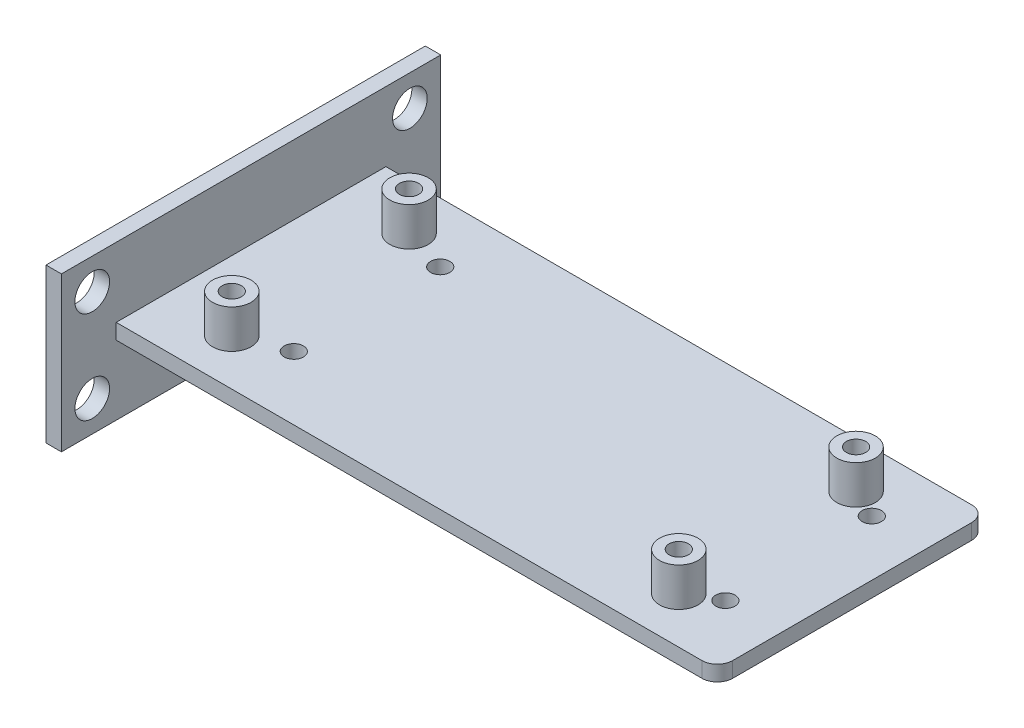
ISO-10303-21;
HEADER;
FILE_DESCRIPTION(('STEP AP214'),'2;1');
FILE_NAME('part.step','',(''),(''),'','','');
FILE_SCHEMA(('AUTOMOTIVE_DESIGN { 1 0 10303 214 1 1 1 1 }'));
ENDSEC;
DATA;
#1=APPLICATION_CONTEXT('core data for automotive mechanical design processes');
#2=APPLICATION_PROTOCOL_DEFINITION('international standard','automotive_design',2000,#1);
#3=PRODUCT_CONTEXT('',#1,'mechanical');
#4=PRODUCT('Part','Part','',(#3));
#5=PRODUCT_RELATED_PRODUCT_CATEGORY('part','',(#4));
#6=PRODUCT_DEFINITION_FORMATION('','',#4);
#7=PRODUCT_DEFINITION_CONTEXT('part definition',#1,'design');
#8=PRODUCT_DEFINITION('design','',#6,#7);
#9=PRODUCT_DEFINITION_SHAPE('','',#8);
#10=(LENGTH_UNIT() NAMED_UNIT(*) SI_UNIT(.MILLI.,.METRE.));
#11=(NAMED_UNIT(*) PLANE_ANGLE_UNIT() SI_UNIT($,.RADIAN.));
#12=(NAMED_UNIT(*) SI_UNIT($,.STERADIAN.) SOLID_ANGLE_UNIT());
#13=UNCERTAINTY_MEASURE_WITH_UNIT(LENGTH_MEASURE(1.E-05),#10,'distance_accuracy_value','');
#14=(GEOMETRIC_REPRESENTATION_CONTEXT(3) GLOBAL_UNCERTAINTY_ASSIGNED_CONTEXT((#13)) GLOBAL_UNIT_ASSIGNED_CONTEXT((#10,
#11,#12)) REPRESENTATION_CONTEXT('',''));
#15=CARTESIAN_POINT('',(0.,0.,0.));
#16=DIRECTION('',(0.,0.,1.));
#17=DIRECTION('',(1.,0.,0.));
#18=AXIS2_PLACEMENT_3D('',#15,#16,#17);
#19=CARTESIAN_POINT('',(0.,0.,0.));
#20=DIRECTION('',(0.,1.,0.));
#21=DIRECTION('',(0.,0.,1.));
#22=AXIS2_PLACEMENT_3D('',#19,#20,#21);
#23=PLANE('',#22);
#24=CARTESIAN_POINT('',(16.7893297206262,0.,7.74598307480065));
#25=DIRECTION('',(0.,1.,0.));
#26=DIRECTION('',(0.,0.,1.));
#27=AXIS2_PLACEMENT_3D('',#24,#25,#26);
#28=CIRCLE('',#27,2.5);
#29=CARTESIAN_POINT('',(16.7893297206262,0.,10.2459830748006));
#30=VERTEX_POINT('',#29);
#31=EDGE_CURVE('E42',#30,#30,#28,.F.);
#32=ORIENTED_EDGE('',*,*,#31,.F.);
#33=EDGE_LOOP('',(#32));
#34=FACE_BOUND('',#33,.T.);
#35=CARTESIAN_POINT('',(72.789329720626,0.,26.7459830748007));
#36=DIRECTION('',(0.,1.,0.));
#37=DIRECTION('',(0.,0.,1.));
#38=AXIS2_PLACEMENT_3D('',#35,#36,#37);
#39=CIRCLE('',#38,2.50000000000001);
#40=CARTESIAN_POINT('',(72.789329720626,0.,29.2459830748007));
#41=VERTEX_POINT('',#40);
#42=EDGE_CURVE('E289',#41,#41,#39,.F.);
#43=ORIENTED_EDGE('',*,*,#42,.F.);
#44=EDGE_LOOP('',(#43));
#45=FACE_BOUND('',#44,.T.);
#46=CARTESIAN_POINT('',(11.,0.,6.00000000000001));
#47=DIRECTION('',(0.,1.,0.));
#48=DIRECTION('',(0.,0.,1.));
#49=AXIS2_PLACEMENT_3D('',#46,#47,#48);
#50=CIRCLE('',#49,1.25);
#51=CARTESIAN_POINT('',(11.,0.,7.25000000000001));
#52=VERTEX_POINT('',#51);
#53=EDGE_CURVE('E204',#52,#52,#50,.T.);
#54=ORIENTED_EDGE('',*,*,#53,.T.);
#55=EDGE_LOOP('',(#54));
#56=FACE_BOUND('',#55,.T.);
#57=CARTESIAN_POINT('',(69.,0.,29.));
#58=DIRECTION('',(0.,1.,0.));
#59=DIRECTION('',(0.,0.,1.));
#60=AXIS2_PLACEMENT_3D('',#57,#58,#59);
#61=CIRCLE('',#60,1.25);
#62=CARTESIAN_POINT('',(69.,0.,30.25));
#63=VERTEX_POINT('',#62);
#64=EDGE_CURVE('E197',#63,#63,#61,.T.);
#65=ORIENTED_EDGE('',*,*,#64,.T.);
#66=EDGE_LOOP('',(#65));
#67=FACE_BOUND('',#66,.T.);
#68=CARTESIAN_POINT('',(69.,0.,5.99999999999999));
#69=DIRECTION('',(0.,1.,0.));
#70=DIRECTION('',(0.,0.,1.));
#71=AXIS2_PLACEMENT_3D('',#68,#69,#70);
#72=CIRCLE('',#71,1.25);
#73=CARTESIAN_POINT('',(69.,0.,7.24999999999999));
#74=VERTEX_POINT('',#73);
#75=EDGE_CURVE('E200',#74,#74,#72,.T.);
#76=ORIENTED_EDGE('',*,*,#75,.T.);
#77=EDGE_LOOP('',(#76));
#78=FACE_BOUND('',#77,.T.);
#79=CARTESIAN_POINT('',(11.,0.,29.));
#80=DIRECTION('',(0.,1.,0.));
#81=DIRECTION('',(0.,0.,1.));
#82=AXIS2_PLACEMENT_3D('',#79,#80,#81);
#83=CIRCLE('',#82,1.25);
#84=CARTESIAN_POINT('',(11.,0.,30.25));
#85=VERTEX_POINT('',#84);
#86=EDGE_CURVE('E201',#85,#85,#83,.T.);
#87=ORIENTED_EDGE('',*,*,#86,.T.);
#88=EDGE_LOOP('',(#87));
#89=FACE_BOUND('',#88,.T.);
#90=CARTESIAN_POINT('',(16.789329720626,0.,26.7459830748006));
#91=DIRECTION('',(0.,1.,0.));
#92=DIRECTION('',(0.,0.,1.));
#93=AXIS2_PLACEMENT_3D('',#90,#91,#92);
#94=CIRCLE('',#93,2.5);
#95=CARTESIAN_POINT('',(16.789329720626,0.,29.2459830748006));
#96=VERTEX_POINT('',#95);
#97=EDGE_CURVE('E286',#96,#96,#94,.F.);
#98=ORIENTED_EDGE('',*,*,#97,.F.);
#99=EDGE_LOOP('',(#98));
#100=FACE_BOUND('',#99,.T.);
#101=CARTESIAN_POINT('',(72.7893297206262,0.,7.74598307480064));
#102=DIRECTION('',(0.,1.,0.));
#103=DIRECTION('',(0.,0.,1.));
#104=AXIS2_PLACEMENT_3D('',#101,#102,#103);
#105=CIRCLE('',#104,2.49999999999999);
#106=CARTESIAN_POINT('',(72.7893297206262,0.,10.2459830748006));
#107=VERTEX_POINT('',#106);
#108=EDGE_CURVE('E292',#107,#107,#105,.F.);
#109=ORIENTED_EDGE('',*,*,#108,.F.);
#110=EDGE_LOOP('',(#109));
#111=FACE_BOUND('',#110,.T.);
#112=DIRECTION('',(0.,0.,1.));
#113=VECTOR('',#112,1.);
#114=CARTESIAN_POINT('',(2.,0.,0.));
#115=LINE('',#114,#113);
#116=CARTESIAN_POINT('',(2.,0.,0.));
#117=VERTEX_POINT('',#116);
#118=CARTESIAN_POINT('',(2.00000000000001,0.,35.));
#119=VERTEX_POINT('',#118);
#120=EDGE_CURVE('E156',#117,#119,#115,.T.);
#121=ORIENTED_EDGE('',*,*,#120,.F.);
#122=DIRECTION('',(-1.,0.,0.));
#123=VECTOR('',#122,1.);
#124=CARTESIAN_POINT('',(0.,0.,0.));
#125=LINE('',#124,#123);
#126=CARTESIAN_POINT('',(78.,0.,0.));
#127=VERTEX_POINT('',#126);
#128=EDGE_CURVE('E240',#127,#117,#125,.T.);
#129=ORIENTED_EDGE('',*,*,#128,.F.);
#130=CARTESIAN_POINT('',(78.,0.,2.));
#131=DIRECTION('',(0.,1.,0.));
#132=DIRECTION('',(0.,0.,1.));
#133=AXIS2_PLACEMENT_3D('',#130,#131,#132);
#134=CIRCLE('',#133,2.);
#135=CARTESIAN_POINT('',(80.,0.,2.));
#136=VERTEX_POINT('',#135);
#137=EDGE_CURVE('E49',#127,#136,#134,.F.);
#138=ORIENTED_EDGE('',*,*,#137,.T.);
#139=DIRECTION('',(0.,0.,-1.));
#140=VECTOR('',#139,1.);
#141=CARTESIAN_POINT('',(80.,0.,0.));
#142=LINE('',#141,#140);
#143=CARTESIAN_POINT('',(80.0000000000001,0.,33.));
#144=VERTEX_POINT('',#143);
#145=EDGE_CURVE('E249',#144,#136,#142,.T.);
#146=ORIENTED_EDGE('',*,*,#145,.F.);
#147=CARTESIAN_POINT('',(78.0000000000001,0.,33.));
#148=DIRECTION('',(0.,1.,0.));
#149=DIRECTION('',(0.,0.,1.));
#150=AXIS2_PLACEMENT_3D('',#147,#148,#149);
#151=CIRCLE('',#150,2.);
#152=CARTESIAN_POINT('',(78.0000000000001,0.,35.));
#153=VERTEX_POINT('',#152);
#154=EDGE_CURVE('E275',#144,#153,#151,.F.);
#155=ORIENTED_EDGE('',*,*,#154,.T.);
#156=DIRECTION('',(1.,0.,0.));
#157=VECTOR('',#156,1.);
#158=CARTESIAN_POINT('',(0.,0.,35.));
#159=LINE('',#158,#157);
#160=EDGE_CURVE('E233',#119,#153,#159,.T.);
#161=ORIENTED_EDGE('',*,*,#160,.F.);
#162=EDGE_LOOP('',(#121,#129,#138,#146,#155,#161));
#163=FACE_BOUND('',#162,.T.);
#164=ADVANCED_FACE('F34',(#34,#45,#56,#67,#78,#89,#100,#111,#163),#23,.F.);
#165=CARTESIAN_POINT('',(0.,2.00000000000001,0.));
#166=DIRECTION('',(0.,1.,0.));
#167=DIRECTION('',(0.,0.,1.));
#168=AXIS2_PLACEMENT_3D('',#165,#166,#167);
#169=PLANE('',#168);
#170=CARTESIAN_POINT('',(16.7893297206262,2.00000000000002,7.74598307480065));
#171=DIRECTION('',(0.,1.,0.));
#172=DIRECTION('',(0.,0.,1.));
#173=AXIS2_PLACEMENT_3D('',#170,#171,#172);
#174=CIRCLE('',#173,1.25);
#175=CARTESIAN_POINT('',(16.7893297206262,2.00000000000002,8.99598307480065));
#176=VERTEX_POINT('',#175);
#177=EDGE_CURVE('E194',#176,#176,#174,.T.);
#178=ORIENTED_EDGE('',*,*,#177,.F.);
#179=EDGE_LOOP('',(#178));
#180=FACE_BOUND('',#179,.T.);
#181=CARTESIAN_POINT('',(72.7893297206262,2.00000000000003,7.74598307480065));
#182=DIRECTION('',(0.,1.,0.));
#183=DIRECTION('',(0.,0.,1.));
#184=AXIS2_PLACEMENT_3D('',#181,#182,#183);
#185=CIRCLE('',#184,1.25);
#186=CARTESIAN_POINT('',(72.7893297206262,2.00000000000003,8.99598307480065));
#187=VERTEX_POINT('',#186);
#188=EDGE_CURVE('E191',#187,#187,#185,.T.);
#189=ORIENTED_EDGE('',*,*,#188,.F.);
#190=EDGE_LOOP('',(#189));
#191=FACE_BOUND('',#190,.T.);
#192=CARTESIAN_POINT('',(72.789329720626,2.00000000000004,26.7459830748007));
#193=DIRECTION('',(0.,1.,0.));
#194=DIRECTION('',(0.,0.,1.));
#195=AXIS2_PLACEMENT_3D('',#192,#193,#194);
#196=CIRCLE('',#195,1.25000000000001);
#197=CARTESIAN_POINT('',(72.789329720626,2.00000000000004,27.9959830748007));
#198=VERTEX_POINT('',#197);
#199=EDGE_CURVE('E188',#198,#198,#196,.T.);
#200=ORIENTED_EDGE('',*,*,#199,.F.);
#201=EDGE_LOOP('',(#200));
#202=FACE_BOUND('',#201,.T.);
#203=CARTESIAN_POINT('',(16.789329720626,2.00000000000003,26.7459830748006));
#204=DIRECTION('',(0.,1.,0.));
#205=DIRECTION('',(0.,0.,1.));
#206=AXIS2_PLACEMENT_3D('',#203,#204,#205);
#207=CIRCLE('',#206,1.25);
#208=CARTESIAN_POINT('',(16.789329720626,2.00000000000003,27.9959830748006));
#209=VERTEX_POINT('',#208);
#210=EDGE_CURVE('E185',#209,#209,#207,.T.);
#211=ORIENTED_EDGE('',*,*,#210,.F.);
#212=EDGE_LOOP('',(#211));
#213=FACE_BOUND('',#212,.T.);
#214=CARTESIAN_POINT('',(69.,2.00000000000004,29.));
#215=DIRECTION('',(0.,1.,0.));
#216=DIRECTION('',(0.,0.,1.));
#217=AXIS2_PLACEMENT_3D('',#214,#215,#216);
#218=CIRCLE('',#217,2.5);
#219=CARTESIAN_POINT('',(69.,2.00000000000004,31.5));
#220=VERTEX_POINT('',#219);
#221=EDGE_CURVE('E214',#220,#220,#218,.T.);
#222=ORIENTED_EDGE('',*,*,#221,.F.);
#223=EDGE_LOOP('',(#222));
#224=FACE_BOUND('',#223,.T.);
#225=CARTESIAN_POINT('',(69.,2.00000000000002,5.99999999999999));
#226=DIRECTION('',(0.,1.,0.));
#227=DIRECTION('',(0.,0.,1.));
#228=AXIS2_PLACEMENT_3D('',#225,#226,#227);
#229=CIRCLE('',#228,2.5);
#230=CARTESIAN_POINT('',(69.,2.00000000000002,8.49999999999999));
#231=VERTEX_POINT('',#230);
#232=EDGE_CURVE('E213',#231,#231,#229,.T.);
#233=ORIENTED_EDGE('',*,*,#232,.F.);
#234=EDGE_LOOP('',(#233));
#235=FACE_BOUND('',#234,.T.);
#236=CARTESIAN_POINT('',(11.,2.00000000000003,29.));
#237=DIRECTION('',(0.,1.,0.));
#238=DIRECTION('',(0.,0.,1.));
#239=AXIS2_PLACEMENT_3D('',#236,#237,#238);
#240=CIRCLE('',#239,2.5);
#241=CARTESIAN_POINT('',(11.,2.00000000000003,31.5));
#242=VERTEX_POINT('',#241);
#243=EDGE_CURVE('E221',#242,#242,#240,.T.);
#244=ORIENTED_EDGE('',*,*,#243,.F.);
#245=EDGE_LOOP('',(#244));
#246=FACE_BOUND('',#245,.T.);
#247=CARTESIAN_POINT('',(11.,2.00000000000002,6.00000000000001));
#248=DIRECTION('',(0.,1.,0.));
#249=DIRECTION('',(0.,0.,1.));
#250=AXIS2_PLACEMENT_3D('',#247,#248,#249);
#251=CIRCLE('',#250,2.5);
#252=CARTESIAN_POINT('',(11.,2.00000000000002,8.5));
#253=VERTEX_POINT('',#252);
#254=EDGE_CURVE('E227',#253,#253,#251,.T.);
#255=ORIENTED_EDGE('',*,*,#254,.F.);
#256=EDGE_LOOP('',(#255));
#257=FACE_BOUND('',#256,.T.);
#258=DIRECTION('',(-1.,0.,0.));
#259=VECTOR('',#258,1.);
#260=CARTESIAN_POINT('',(0.,2.00000000000001,0.));
#261=LINE('',#260,#259);
#262=CARTESIAN_POINT('',(78.,2.00000000000002,0.));
#263=VERTEX_POINT('',#262);
#264=CARTESIAN_POINT('',(2.,2.00000000000001,0.));
#265=VERTEX_POINT('',#264);
#266=EDGE_CURVE('E243',#263,#265,#261,.T.);
#267=ORIENTED_EDGE('',*,*,#266,.T.);
#268=DIRECTION('',(0.,0.,1.));
#269=VECTOR('',#268,1.);
#270=CARTESIAN_POINT('',(2.,2.00000000000001,0.));
#271=LINE('',#270,#269);
#272=CARTESIAN_POINT('',(2.00000000000001,2.00000000000003,35.));
#273=VERTEX_POINT('',#272);
#274=EDGE_CURVE('E11',#265,#273,#271,.T.);
#275=ORIENTED_EDGE('',*,*,#274,.T.);
#276=DIRECTION('',(1.,0.,0.));
#277=VECTOR('',#276,1.);
#278=CARTESIAN_POINT('',(0.,2.00000000000003,35.));
#279=LINE('',#278,#277);
#280=CARTESIAN_POINT('',(78.0000000000001,2.00000000000004,35.));
#281=VERTEX_POINT('',#280);
#282=EDGE_CURVE('E236',#273,#281,#279,.T.);
#283=ORIENTED_EDGE('',*,*,#282,.T.);
#284=CARTESIAN_POINT('',(78.0000000000001,2.00000000000004,33.));
#285=DIRECTION('',(0.,1.,0.));
#286=DIRECTION('',(0.,0.,1.));
#287=AXIS2_PLACEMENT_3D('',#284,#285,#286);
#288=CIRCLE('',#287,2.);
#289=CARTESIAN_POINT('',(80.0000000000001,2.00000000000005,33.));
#290=VERTEX_POINT('',#289);
#291=EDGE_CURVE('E277',#281,#290,#288,.T.);
#292=ORIENTED_EDGE('',*,*,#291,.T.);
#293=DIRECTION('',(0.,0.,-1.));
#294=VECTOR('',#293,1.);
#295=CARTESIAN_POINT('',(80.,2.00000000000002,0.));
#296=LINE('',#295,#294);
#297=CARTESIAN_POINT('',(80.,2.00000000000003,2.));
#298=VERTEX_POINT('',#297);
#299=EDGE_CURVE('E239',#290,#298,#296,.T.);
#300=ORIENTED_EDGE('',*,*,#299,.T.);
#301=CARTESIAN_POINT('',(78.,2.00000000000002,2.));
#302=DIRECTION('',(0.,1.,0.));
#303=DIRECTION('',(0.,0.,1.));
#304=AXIS2_PLACEMENT_3D('',#301,#302,#303);
#305=CIRCLE('',#304,2.);
#306=EDGE_CURVE('E56',#298,#263,#305,.T.);
#307=ORIENTED_EDGE('',*,*,#306,.T.);
#308=EDGE_LOOP('',(#267,#275,#283,#292,#300,#307));
#309=FACE_BOUND('',#308,.T.);
#310=ADVANCED_FACE('F301',(#180,#191,#202,#213,#224,#235,#246,#257,#309),#169,.T.);
#311=CARTESIAN_POINT('',(78.,2.00000000000002,2.));
#312=DIRECTION('',(0.,-1.,0.));
#313=DIRECTION('',(0.,0.,-1.));
#314=AXIS2_PLACEMENT_3D('',#311,#312,#313);
#315=CYLINDRICAL_SURFACE('',#314,2.);
#316=DIRECTION('',(0.,-1.,0.));
#317=VECTOR('',#316,1.);
#318=CARTESIAN_POINT('',(78.,2.00000000000002,0.));
#319=LINE('',#318,#317);
#320=EDGE_CURVE('E279',#263,#127,#319,.T.);
#321=ORIENTED_EDGE('',*,*,#320,.F.);
#322=ORIENTED_EDGE('',*,*,#306,.F.);
#323=DIRECTION('',(0.,-1.,0.));
#324=VECTOR('',#323,1.);
#325=CARTESIAN_POINT('',(80.,2.00000000000003,2.));
#326=LINE('',#325,#324);
#327=EDGE_CURVE('E282',#136,#298,#326,.F.);
#328=ORIENTED_EDGE('',*,*,#327,.F.);
#329=ORIENTED_EDGE('',*,*,#137,.F.);
#330=EDGE_LOOP('',(#321,#322,#328,#329));
#331=FACE_BOUND('',#330,.T.);
#332=ADVANCED_FACE('F36',(#331),#315,.T.);
#333=CARTESIAN_POINT('',(78.0000000000001,2.00000000000004,33.));
#334=DIRECTION('',(0.,1.,0.));
#335=DIRECTION('',(0.,0.,1.));
#336=AXIS2_PLACEMENT_3D('',#333,#334,#335);
#337=CYLINDRICAL_SURFACE('',#336,2.);
#338=DIRECTION('',(0.,1.,0.));
#339=VECTOR('',#338,1.);
#340=CARTESIAN_POINT('',(78.0000000000001,2.00000000000004,35.));
#341=LINE('',#340,#339);
#342=EDGE_CURVE('E269',#153,#281,#341,.T.);
#343=ORIENTED_EDGE('',*,*,#342,.F.);
#344=ORIENTED_EDGE('',*,*,#154,.F.);
#345=DIRECTION('',(0.,1.,0.));
#346=VECTOR('',#345,1.);
#347=CARTESIAN_POINT('',(80.0000000000001,2.00000000000005,33.));
#348=LINE('',#347,#346);
#349=EDGE_CURVE('E272',#290,#144,#348,.F.);
#350=ORIENTED_EDGE('',*,*,#349,.F.);
#351=ORIENTED_EDGE('',*,*,#291,.F.);
#352=EDGE_LOOP('',(#343,#344,#350,#351));
#353=FACE_BOUND('',#352,.T.);
#354=ADVANCED_FACE('F327',(#353),#337,.T.);
#355=CARTESIAN_POINT('',(0.,2.00000000000003,35.));
#356=DIRECTION('',(0.,0.,-1.));
#357=DIRECTION('',(-1.,0.,0.));
#358=AXIS2_PLACEMENT_3D('',#355,#356,#357);
#359=PLANE('',#358);
#360=ORIENTED_EDGE('',*,*,#160,.T.);
#361=ORIENTED_EDGE('',*,*,#342,.T.);
#362=ORIENTED_EDGE('',*,*,#282,.F.);
#363=DIRECTION('',(0.,1.,0.));
#364=VECTOR('',#363,1.);
#365=CARTESIAN_POINT('',(2.00000000000001,2.00000000000003,35.));
#366=LINE('',#365,#364);
#367=EDGE_CURVE('E266',#273,#119,#366,.F.);
#368=ORIENTED_EDGE('',*,*,#367,.T.);
#369=EDGE_LOOP('',(#360,#361,#362,#368));
#370=FACE_BOUND('',#369,.T.);
#371=ADVANCED_FACE('F330',(#370),#359,.F.);
#372=CARTESIAN_POINT('',(80.,2.00000000000002,0.));
#373=DIRECTION('',(-1.,0.,0.));
#374=DIRECTION('',(0.,0.,1.));
#375=AXIS2_PLACEMENT_3D('',#372,#373,#374);
#376=PLANE('',#375);
#377=ORIENTED_EDGE('',*,*,#145,.T.);
#378=ORIENTED_EDGE('',*,*,#327,.T.);
#379=ORIENTED_EDGE('',*,*,#299,.F.);
#380=ORIENTED_EDGE('',*,*,#349,.T.);
#381=EDGE_LOOP('',(#377,#378,#379,#380));
#382=FACE_BOUND('',#381,.T.);
#383=ADVANCED_FACE('F323',(#382),#376,.F.);
#384=CARTESIAN_POINT('',(0.,2.00000000000001,0.));
#385=DIRECTION('',(0.,0.,1.));
#386=DIRECTION('',(1.,0.,0.));
#387=AXIS2_PLACEMENT_3D('',#384,#385,#386);
#388=PLANE('',#387);
#389=ORIENTED_EDGE('',*,*,#266,.F.);
#390=ORIENTED_EDGE('',*,*,#320,.T.);
#391=ORIENTED_EDGE('',*,*,#128,.T.);
#392=DIRECTION('',(0.,-1.,0.));
#393=VECTOR('',#392,1.);
#394=CARTESIAN_POINT('',(2.,2.00000000000001,0.));
#395=LINE('',#394,#393);
#396=EDGE_CURVE('E246',#117,#265,#395,.F.);
#397=ORIENTED_EDGE('',*,*,#396,.T.);
#398=EDGE_LOOP('',(#389,#390,#391,#397));
#399=FACE_BOUND('',#398,.T.);
#400=ADVANCED_FACE('F320',(#399),#388,.F.);
#401=CARTESIAN_POINT('',(11.,7.00000000000002,6.00000000000001));
#402=DIRECTION('',(0.,-1.,0.));
#403=DIRECTION('',(0.,0.,-1.));
#404=AXIS2_PLACEMENT_3D('',#401,#402,#403);
#405=CYLINDRICAL_SURFACE('',#404,2.5);
#406=CARTESIAN_POINT('',(11.,7.00000000000002,6.00000000000001));
#407=DIRECTION('',(0.,1.,0.));
#408=DIRECTION('',(0.,0.,1.));
#409=AXIS2_PLACEMENT_3D('',#406,#407,#408);
#410=CIRCLE('',#409,2.5);
#411=CARTESIAN_POINT('',(11.,7.00000000000002,8.5));
#412=VERTEX_POINT('',#411);
#413=EDGE_CURVE('E230',#412,#412,#410,.T.);
#414=ORIENTED_EDGE('',*,*,#413,.F.);
#415=EDGE_LOOP('',(#414));
#416=FACE_BOUND('',#415,.T.);
#417=ORIENTED_EDGE('',*,*,#254,.T.);
#418=EDGE_LOOP('',(#417));
#419=FACE_BOUND('',#418,.T.);
#420=ADVANCED_FACE('F341',(#416,#419),#405,.T.);
#421=CARTESIAN_POINT('',(11.,7.00000000000002,6.00000000000001));
#422=DIRECTION('',(0.,1.,0.));
#423=DIRECTION('',(0.,0.,1.));
#424=AXIS2_PLACEMENT_3D('',#421,#422,#423);
#425=PLANE('',#424);
#426=CARTESIAN_POINT('',(11.,7.00000000000002,6.00000000000001));
#427=DIRECTION('',(0.,1.,0.));
#428=DIRECTION('',(0.,0.,1.));
#429=AXIS2_PLACEMENT_3D('',#426,#427,#428);
#430=CIRCLE('',#429,1.25);
#431=CARTESIAN_POINT('',(11.,7.00000000000002,7.25000000000001));
#432=VERTEX_POINT('',#431);
#433=EDGE_CURVE('E217',#432,#432,#430,.T.);
#434=ORIENTED_EDGE('',*,*,#433,.F.);
#435=EDGE_LOOP('',(#434));
#436=FACE_BOUND('',#435,.T.);
#437=ORIENTED_EDGE('',*,*,#413,.T.);
#438=EDGE_LOOP('',(#437));
#439=FACE_BOUND('',#438,.T.);
#440=ADVANCED_FACE('F377',(#436,#439),#425,.T.);
#441=CARTESIAN_POINT('',(11.,7.00000000000004,29.));
#442=DIRECTION('',(0.,-1.,0.));
#443=DIRECTION('',(0.,0.,-1.));
#444=AXIS2_PLACEMENT_3D('',#441,#442,#443);
#445=CYLINDRICAL_SURFACE('',#444,2.5);
#446=CARTESIAN_POINT('',(11.,7.00000000000004,29.));
#447=DIRECTION('',(0.,1.,0.));
#448=DIRECTION('',(0.,0.,1.));
#449=AXIS2_PLACEMENT_3D('',#446,#447,#448);
#450=CIRCLE('',#449,2.5);
#451=CARTESIAN_POINT('',(11.,7.00000000000004,31.5));
#452=VERTEX_POINT('',#451);
#453=EDGE_CURVE('E224',#452,#452,#450,.T.);
#454=ORIENTED_EDGE('',*,*,#453,.F.);
#455=EDGE_LOOP('',(#454));
#456=FACE_BOUND('',#455,.T.);
#457=ORIENTED_EDGE('',*,*,#243,.T.);
#458=EDGE_LOOP('',(#457));
#459=FACE_BOUND('',#458,.T.);
#460=ADVANCED_FACE('F384',(#456,#459),#445,.T.);
#461=CARTESIAN_POINT('',(11.,7.00000000000004,29.));
#462=DIRECTION('',(0.,1.,0.));
#463=DIRECTION('',(0.,0.,1.));
#464=AXIS2_PLACEMENT_3D('',#461,#462,#463);
#465=PLANE('',#464);
#466=CARTESIAN_POINT('',(11.,7.00000000000004,29.));
#467=DIRECTION('',(0.,1.,0.));
#468=DIRECTION('',(0.,0.,1.));
#469=AXIS2_PLACEMENT_3D('',#466,#467,#468);
#470=CIRCLE('',#469,1.25);
#471=CARTESIAN_POINT('',(11.,7.00000000000004,30.25));
#472=VERTEX_POINT('',#471);
#473=EDGE_CURVE('E259',#472,#472,#470,.T.);
#474=ORIENTED_EDGE('',*,*,#473,.F.);
#475=EDGE_LOOP('',(#474));
#476=FACE_BOUND('',#475,.T.);
#477=ORIENTED_EDGE('',*,*,#453,.T.);
#478=EDGE_LOOP('',(#477));
#479=FACE_BOUND('',#478,.T.);
#480=ADVANCED_FACE('F391',(#476,#479),#465,.T.);
#481=CARTESIAN_POINT('',(69.,7.00000000000003,5.99999999999999));
#482=DIRECTION('',(0.,-1.,0.));
#483=DIRECTION('',(0.,0.,-1.));
#484=AXIS2_PLACEMENT_3D('',#481,#482,#483);
#485=CYLINDRICAL_SURFACE('',#484,2.5);
#486=CARTESIAN_POINT('',(69.,7.00000000000003,5.99999999999999));
#487=DIRECTION('',(0.,1.,0.));
#488=DIRECTION('',(0.,0.,1.));
#489=AXIS2_PLACEMENT_3D('',#486,#487,#488);
#490=CIRCLE('',#489,2.5);
#491=CARTESIAN_POINT('',(69.,7.00000000000003,8.49999999999999));
#492=VERTEX_POINT('',#491);
#493=EDGE_CURVE('E218',#492,#492,#490,.T.);
#494=ORIENTED_EDGE('',*,*,#493,.F.);
#495=EDGE_LOOP('',(#494));
#496=FACE_BOUND('',#495,.T.);
#497=ORIENTED_EDGE('',*,*,#232,.T.);
#498=EDGE_LOOP('',(#497));
#499=FACE_BOUND('',#498,.T.);
#500=ADVANCED_FACE('F399',(#496,#499),#485,.T.);
#501=CARTESIAN_POINT('',(69.,7.00000000000003,5.99999999999999));
#502=DIRECTION('',(0.,1.,0.));
#503=DIRECTION('',(0.,0.,1.));
#504=AXIS2_PLACEMENT_3D('',#501,#502,#503);
#505=PLANE('',#504);
#506=CARTESIAN_POINT('',(69.,7.00000000000003,5.99999999999999));
#507=DIRECTION('',(0.,1.,0.));
#508=DIRECTION('',(0.,0.,1.));
#509=AXIS2_PLACEMENT_3D('',#506,#507,#508);
#510=CIRCLE('',#509,1.25);
#511=CARTESIAN_POINT('',(69.,7.00000000000003,7.24999999999999));
#512=VERTEX_POINT('',#511);
#513=EDGE_CURVE('E256',#512,#512,#510,.T.);
#514=ORIENTED_EDGE('',*,*,#513,.F.);
#515=EDGE_LOOP('',(#514));
#516=FACE_BOUND('',#515,.T.);
#517=ORIENTED_EDGE('',*,*,#493,.T.);
#518=EDGE_LOOP('',(#517));
#519=FACE_BOUND('',#518,.T.);
#520=ADVANCED_FACE('F407',(#516,#519),#505,.T.);
#521=CARTESIAN_POINT('',(69.,7.00000000000005,29.));
#522=DIRECTION('',(0.,-1.,0.));
#523=DIRECTION('',(0.,0.,-1.));
#524=AXIS2_PLACEMENT_3D('',#521,#522,#523);
#525=CYLINDRICAL_SURFACE('',#524,2.5);
#526=CARTESIAN_POINT('',(69.,7.00000000000005,29.));
#527=DIRECTION('',(0.,1.,0.));
#528=DIRECTION('',(0.,0.,1.));
#529=AXIS2_PLACEMENT_3D('',#526,#527,#528);
#530=CIRCLE('',#529,2.5);
#531=CARTESIAN_POINT('',(69.,7.00000000000006,31.5));
#532=VERTEX_POINT('',#531);
#533=EDGE_CURVE('E210',#532,#532,#530,.T.);
#534=ORIENTED_EDGE('',*,*,#533,.F.);
#535=EDGE_LOOP('',(#534));
#536=FACE_BOUND('',#535,.T.);
#537=ORIENTED_EDGE('',*,*,#221,.T.);
#538=EDGE_LOOP('',(#537));
#539=FACE_BOUND('',#538,.T.);
#540=ADVANCED_FACE('F415',(#536,#539),#525,.T.);
#541=CARTESIAN_POINT('',(69.,7.00000000000005,29.));
#542=DIRECTION('',(0.,1.,0.));
#543=DIRECTION('',(0.,0.,1.));
#544=AXIS2_PLACEMENT_3D('',#541,#542,#543);
#545=PLANE('',#544);
#546=CARTESIAN_POINT('',(69.,7.00000000000005,29.));
#547=DIRECTION('',(0.,1.,0.));
#548=DIRECTION('',(0.,0.,1.));
#549=AXIS2_PLACEMENT_3D('',#546,#547,#548);
#550=CIRCLE('',#549,1.25);
#551=CARTESIAN_POINT('',(69.,7.00000000000005,30.25));
#552=VERTEX_POINT('',#551);
#553=EDGE_CURVE('E209',#552,#552,#550,.T.);
#554=ORIENTED_EDGE('',*,*,#553,.F.);
#555=EDGE_LOOP('',(#554));
#556=FACE_BOUND('',#555,.T.);
#557=ORIENTED_EDGE('',*,*,#533,.T.);
#558=EDGE_LOOP('',(#557));
#559=FACE_BOUND('',#558,.T.);
#560=ADVANCED_FACE('F423',(#556,#559),#545,.T.);
#561=CARTESIAN_POINT('',(69.,0.,29.));
#562=DIRECTION('',(0.,1.,0.));
#563=DIRECTION('',(0.,0.,1.));
#564=AXIS2_PLACEMENT_3D('',#561,#562,#563);
#565=CYLINDRICAL_SURFACE('',#564,1.25);
#566=ORIENTED_EDGE('',*,*,#553,.T.);
#567=EDGE_LOOP('',(#566));
#568=FACE_BOUND('',#567,.T.);
#569=ORIENTED_EDGE('',*,*,#64,.F.);
#570=EDGE_LOOP('',(#569));
#571=FACE_BOUND('',#570,.T.);
#572=ADVANCED_FACE('F431',(#568,#571),#565,.F.);
#573=CARTESIAN_POINT('',(69.,0.,5.99999999999999));
#574=DIRECTION('',(0.,1.,0.));
#575=DIRECTION('',(0.,0.,1.));
#576=AXIS2_PLACEMENT_3D('',#573,#574,#575);
#577=CYLINDRICAL_SURFACE('',#576,1.25);
#578=ORIENTED_EDGE('',*,*,#513,.T.);
#579=EDGE_LOOP('',(#578));
#580=FACE_BOUND('',#579,.T.);
#581=ORIENTED_EDGE('',*,*,#75,.F.);
#582=EDGE_LOOP('',(#581));
#583=FACE_BOUND('',#582,.T.);
#584=ADVANCED_FACE('F439',(#580,#583),#577,.F.);
#585=CARTESIAN_POINT('',(11.,0.,29.));
#586=DIRECTION('',(0.,1.,0.));
#587=DIRECTION('',(0.,0.,1.));
#588=AXIS2_PLACEMENT_3D('',#585,#586,#587);
#589=CYLINDRICAL_SURFACE('',#588,1.25);
#590=ORIENTED_EDGE('',*,*,#473,.T.);
#591=EDGE_LOOP('',(#590));
#592=FACE_BOUND('',#591,.T.);
#593=ORIENTED_EDGE('',*,*,#86,.F.);
#594=EDGE_LOOP('',(#593));
#595=FACE_BOUND('',#594,.T.);
#596=ADVANCED_FACE('F447',(#592,#595),#589,.F.);
#597=CARTESIAN_POINT('',(11.,0.,6.00000000000001));
#598=DIRECTION('',(0.,1.,0.));
#599=DIRECTION('',(0.,0.,1.));
#600=AXIS2_PLACEMENT_3D('',#597,#598,#599);
#601=CYLINDRICAL_SURFACE('',#600,1.25);
#602=ORIENTED_EDGE('',*,*,#433,.T.);
#603=EDGE_LOOP('',(#602));
#604=FACE_BOUND('',#603,.T.);
#605=ORIENTED_EDGE('',*,*,#53,.F.);
#606=EDGE_LOOP('',(#605));
#607=FACE_BOUND('',#606,.T.);
#608=ADVANCED_FACE('F455',(#604,#607),#601,.F.);
#609=CARTESIAN_POINT('',(16.789329720626,10.,26.7459830748006));
#610=DIRECTION('',(0.,-1.,0.));
#611=DIRECTION('',(0.,0.,-1.));
#612=AXIS2_PLACEMENT_3D('',#609,#610,#611);
#613=CYLINDRICAL_SURFACE('',#612,1.25);
#614=ORIENTED_EDGE('',*,*,#210,.T.);
#615=EDGE_LOOP('',(#614));
#616=FACE_BOUND('',#615,.T.);
#617=CARTESIAN_POINT('',(16.789329720626,-3.99999999999999,26.7459830748006));
#618=DIRECTION('',(0.,-1.,0.));
#619=DIRECTION('',(0.,0.,-1.));
#620=AXIS2_PLACEMENT_3D('',#617,#618,#619);
#621=CIRCLE('',#620,1.25);
#622=CARTESIAN_POINT('',(16.789329720626,-3.99999999999999,25.4959830748006));
#623=VERTEX_POINT('',#622);
#624=EDGE_CURVE('E179',#623,#623,#621,.T.);
#625=ORIENTED_EDGE('',*,*,#624,.T.);
#626=EDGE_LOOP('',(#625));
#627=FACE_BOUND('',#626,.T.);
#628=ADVANCED_FACE('F463',(#616,#627),#613,.F.);
#629=CARTESIAN_POINT('',(72.789329720626,10.0000000000001,26.7459830748007));
#630=DIRECTION('',(0.,-1.,0.));
#631=DIRECTION('',(0.,0.,-1.));
#632=AXIS2_PLACEMENT_3D('',#629,#630,#631);
#633=CYLINDRICAL_SURFACE('',#632,1.25000000000001);
#634=ORIENTED_EDGE('',*,*,#199,.T.);
#635=EDGE_LOOP('',(#634));
#636=FACE_BOUND('',#635,.T.);
#637=CARTESIAN_POINT('',(72.789329720626,-3.99999999999998,26.7459830748007));
#638=DIRECTION('',(0.,-1.,0.));
#639=DIRECTION('',(0.,0.,-1.));
#640=AXIS2_PLACEMENT_3D('',#637,#638,#639);
#641=CIRCLE('',#640,1.25000000000001);
#642=CARTESIAN_POINT('',(72.789329720626,-3.99999999999999,25.4959830748007));
#643=VERTEX_POINT('',#642);
#644=EDGE_CURVE('E173',#643,#643,#641,.T.);
#645=ORIENTED_EDGE('',*,*,#644,.T.);
#646=EDGE_LOOP('',(#645));
#647=FACE_BOUND('',#646,.T.);
#648=ADVANCED_FACE('F471',(#636,#647),#633,.F.);
#649=CARTESIAN_POINT('',(72.7893297206262,10.,7.74598307480065));
#650=DIRECTION('',(0.,-1.,0.));
#651=DIRECTION('',(0.,0.,-1.));
#652=AXIS2_PLACEMENT_3D('',#649,#650,#651);
#653=CYLINDRICAL_SURFACE('',#652,1.25);
#654=ORIENTED_EDGE('',*,*,#188,.T.);
#655=EDGE_LOOP('',(#654));
#656=FACE_BOUND('',#655,.T.);
#657=CARTESIAN_POINT('',(72.7893297206262,-3.99999999999999,7.74598307480064));
#658=DIRECTION('',(0.,-1.,0.));
#659=DIRECTION('',(0.,0.,-1.));
#660=AXIS2_PLACEMENT_3D('',#657,#658,#659);
#661=CIRCLE('',#660,1.25);
#662=CARTESIAN_POINT('',(72.7893297206262,-3.99999999999999,6.49598307480064));
#663=VERTEX_POINT('',#662);
#664=EDGE_CURVE('E167',#663,#663,#661,.T.);
#665=ORIENTED_EDGE('',*,*,#664,.T.);
#666=EDGE_LOOP('',(#665));
#667=FACE_BOUND('',#666,.T.);
#668=ADVANCED_FACE('F479',(#656,#667),#653,.F.);
#669=CARTESIAN_POINT('',(16.7893297206262,10.,7.74598307480065));
#670=DIRECTION('',(0.,-1.,0.));
#671=DIRECTION('',(0.,0.,-1.));
#672=AXIS2_PLACEMENT_3D('',#669,#670,#671);
#673=CYLINDRICAL_SURFACE('',#672,1.25);
#674=ORIENTED_EDGE('',*,*,#177,.T.);
#675=EDGE_LOOP('',(#674));
#676=FACE_BOUND('',#675,.T.);
#677=CARTESIAN_POINT('',(16.7893297206262,-4.,7.74598307480065));
#678=DIRECTION('',(0.,-1.,0.));
#679=DIRECTION('',(0.,0.,-1.));
#680=AXIS2_PLACEMENT_3D('',#677,#678,#679);
#681=CIRCLE('',#680,1.25);
#682=CARTESIAN_POINT('',(16.7893297206262,-4.,6.49598307480065));
#683=VERTEX_POINT('',#682);
#684=EDGE_CURVE('E161',#683,#683,#681,.T.);
#685=ORIENTED_EDGE('',*,*,#684,.T.);
#686=EDGE_LOOP('',(#685));
#687=FACE_BOUND('',#686,.T.);
#688=ADVANCED_FACE('F487',(#676,#687),#673,.F.);
#689=CARTESIAN_POINT('',(16.789329720626,-3.99999999999999,26.7459830748006));
#690=DIRECTION('',(0.,-1.,0.));
#691=DIRECTION('',(0.,0.,-1.));
#692=AXIS2_PLACEMENT_3D('',#689,#690,#691);
#693=PLANE('',#692);
#694=CARTESIAN_POINT('',(16.789329720626,-3.99999999999999,26.7459830748006));
#695=DIRECTION('',(0.,-1.,0.));
#696=DIRECTION('',(0.,0.,-1.));
#697=AXIS2_PLACEMENT_3D('',#694,#695,#696);
#698=CIRCLE('',#697,2.5);
#699=CARTESIAN_POINT('',(16.789329720626,-3.99999999999999,24.2459830748006));
#700=VERTEX_POINT('',#699);
#701=EDGE_CURVE('E182',#700,#700,#698,.T.);
#702=ORIENTED_EDGE('',*,*,#701,.T.);
#703=EDGE_LOOP('',(#702));
#704=FACE_BOUND('',#703,.T.);
#705=ORIENTED_EDGE('',*,*,#624,.F.);
#706=EDGE_LOOP('',(#705));
#707=FACE_BOUND('',#706,.T.);
#708=ADVANCED_FACE('F495',(#704,#707),#693,.T.);
#709=CARTESIAN_POINT('',(16.789329720626,-3.99999999999999,26.7459830748006));
#710=DIRECTION('',(0.,1.,0.));
#711=DIRECTION('',(0.,0.,1.));
#712=AXIS2_PLACEMENT_3D('',#709,#710,#711);
#713=CYLINDRICAL_SURFACE('',#712,2.5);
#714=ORIENTED_EDGE('',*,*,#701,.F.);
#715=EDGE_LOOP('',(#714));
#716=FACE_BOUND('',#715,.T.);
#717=ORIENTED_EDGE('',*,*,#97,.T.);
#718=EDGE_LOOP('',(#717));
#719=FACE_BOUND('',#718,.T.);
#720=ADVANCED_FACE('F503',(#716,#719),#713,.T.);
#721=CARTESIAN_POINT('',(72.789329720626,-3.99999999999998,26.7459830748007));
#722=DIRECTION('',(0.,-1.,0.));
#723=DIRECTION('',(0.,0.,-1.));
#724=AXIS2_PLACEMENT_3D('',#721,#722,#723);
#725=PLANE('',#724);
#726=CARTESIAN_POINT('',(72.789329720626,-3.99999999999998,26.7459830748007));
#727=DIRECTION('',(0.,-1.,0.));
#728=DIRECTION('',(0.,0.,-1.));
#729=AXIS2_PLACEMENT_3D('',#726,#727,#728);
#730=CIRCLE('',#729,2.50000000000001);
#731=CARTESIAN_POINT('',(72.789329720626,-3.99999999999999,24.2459830748007));
#732=VERTEX_POINT('',#731);
#733=EDGE_CURVE('E176',#732,#732,#730,.T.);
#734=ORIENTED_EDGE('',*,*,#733,.T.);
#735=EDGE_LOOP('',(#734));
#736=FACE_BOUND('',#735,.T.);
#737=ORIENTED_EDGE('',*,*,#644,.F.);
#738=EDGE_LOOP('',(#737));
#739=FACE_BOUND('',#738,.T.);
#740=ADVANCED_FACE('F511',(#736,#739),#725,.T.);
#741=CARTESIAN_POINT('',(72.789329720626,-3.99999999999998,26.7459830748007));
#742=DIRECTION('',(0.,1.,0.));
#743=DIRECTION('',(0.,0.,1.));
#744=AXIS2_PLACEMENT_3D('',#741,#742,#743);
#745=CYLINDRICAL_SURFACE('',#744,2.50000000000001);
#746=ORIENTED_EDGE('',*,*,#733,.F.);
#747=EDGE_LOOP('',(#746));
#748=FACE_BOUND('',#747,.T.);
#749=ORIENTED_EDGE('',*,*,#42,.T.);
#750=EDGE_LOOP('',(#749));
#751=FACE_BOUND('',#750,.T.);
#752=ADVANCED_FACE('F519',(#748,#751),#745,.T.);
#753=CARTESIAN_POINT('',(72.7893297206262,-3.99999999999999,7.74598307480064));
#754=DIRECTION('',(0.,-1.,0.));
#755=DIRECTION('',(0.,0.,-1.));
#756=AXIS2_PLACEMENT_3D('',#753,#754,#755);
#757=PLANE('',#756);
#758=CARTESIAN_POINT('',(72.7893297206262,-3.99999999999999,7.74598307480064));
#759=DIRECTION('',(0.,-1.,0.));
#760=DIRECTION('',(0.,0.,-1.));
#761=AXIS2_PLACEMENT_3D('',#758,#759,#760);
#762=CIRCLE('',#761,2.49999999999999);
#763=CARTESIAN_POINT('',(72.7893297206262,-3.99999999999999,5.24598307480064));
#764=VERTEX_POINT('',#763);
#765=EDGE_CURVE('E170',#764,#764,#762,.T.);
#766=ORIENTED_EDGE('',*,*,#765,.T.);
#767=EDGE_LOOP('',(#766));
#768=FACE_BOUND('',#767,.T.);
#769=ORIENTED_EDGE('',*,*,#664,.F.);
#770=EDGE_LOOP('',(#769));
#771=FACE_BOUND('',#770,.T.);
#772=ADVANCED_FACE('F527',(#768,#771),#757,.T.);
#773=CARTESIAN_POINT('',(72.7893297206262,-3.99999999999999,7.74598307480064));
#774=DIRECTION('',(0.,1.,0.));
#775=DIRECTION('',(0.,0.,1.));
#776=AXIS2_PLACEMENT_3D('',#773,#774,#775);
#777=CYLINDRICAL_SURFACE('',#776,2.49999999999999);
#778=ORIENTED_EDGE('',*,*,#765,.F.);
#779=EDGE_LOOP('',(#778));
#780=FACE_BOUND('',#779,.T.);
#781=ORIENTED_EDGE('',*,*,#108,.T.);
#782=EDGE_LOOP('',(#781));
#783=FACE_BOUND('',#782,.T.);
#784=ADVANCED_FACE('F535',(#780,#783),#777,.T.);
#785=CARTESIAN_POINT('',(16.7893297206262,-4.,7.74598307480065));
#786=DIRECTION('',(0.,-1.,0.));
#787=DIRECTION('',(0.,0.,-1.));
#788=AXIS2_PLACEMENT_3D('',#785,#786,#787);
#789=PLANE('',#788);
#790=CARTESIAN_POINT('',(16.7893297206262,-4.,7.74598307480065));
#791=DIRECTION('',(0.,-1.,0.));
#792=DIRECTION('',(0.,0.,-1.));
#793=AXIS2_PLACEMENT_3D('',#790,#791,#792);
#794=CIRCLE('',#793,2.5);
#795=CARTESIAN_POINT('',(16.7893297206262,-4.,5.24598307480065));
#796=VERTEX_POINT('',#795);
#797=EDGE_CURVE('E164',#796,#796,#794,.T.);
#798=ORIENTED_EDGE('',*,*,#797,.T.);
#799=EDGE_LOOP('',(#798));
#800=FACE_BOUND('',#799,.T.);
#801=ORIENTED_EDGE('',*,*,#684,.F.);
#802=EDGE_LOOP('',(#801));
#803=FACE_BOUND('',#802,.T.);
#804=ADVANCED_FACE('F543',(#800,#803),#789,.T.);
#805=CARTESIAN_POINT('',(16.7893297206262,-4.,7.74598307480065));
#806=DIRECTION('',(0.,1.,0.));
#807=DIRECTION('',(0.,0.,1.));
#808=AXIS2_PLACEMENT_3D('',#805,#806,#807);
#809=CYLINDRICAL_SURFACE('',#808,2.5);
#810=ORIENTED_EDGE('',*,*,#797,.F.);
#811=EDGE_LOOP('',(#810));
#812=FACE_BOUND('',#811,.T.);
#813=ORIENTED_EDGE('',*,*,#31,.T.);
#814=EDGE_LOOP('',(#813));
#815=FACE_BOUND('',#814,.T.);
#816=ADVANCED_FACE('F297',(#812,#815),#809,.T.);
#817=CARTESIAN_POINT('',(2.,0.,0.));
#818=DIRECTION('',(-1.,0.,0.));
#819=DIRECTION('',(0.,0.,1.));
#820=AXIS2_PLACEMENT_3D('',#817,#818,#819);
#821=PLANE('',#820);
#822=CARTESIAN_POINT('',(2.00000000000002,7.00000000000004,38.1093710783931));
#823=DIRECTION('',(-1.,0.,0.));
#824=DIRECTION('',(0.,0.,-1.));
#825=AXIS2_PLACEMENT_3D('',#822,#823,#824);
#826=CIRCLE('',#825,2.25);
#827=CARTESIAN_POINT('',(2.00000000000001,7.00000000000003,35.8593710783931));
#828=VERTEX_POINT('',#827);
#829=EDGE_CURVE('E739',#828,#828,#826,.T.);
#830=ORIENTED_EDGE('',*,*,#829,.T.);
#831=EDGE_LOOP('',(#830));
#832=FACE_BOUND('',#831,.T.);
#833=CARTESIAN_POINT('',(2.,7.00000000000001,-3.10937107839313));
#834=DIRECTION('',(-1.,0.,0.));
#835=DIRECTION('',(0.,0.,1.));
#836=AXIS2_PLACEMENT_3D('',#833,#834,#835);
#837=CIRCLE('',#836,2.25);
#838=CARTESIAN_POINT('',(2.00000000000001,7.00000000000001,-0.859371078393123));
#839=VERTEX_POINT('',#838);
#840=EDGE_CURVE('E748',#839,#839,#837,.T.);
#841=ORIENTED_EDGE('',*,*,#840,.T.);
#842=EDGE_LOOP('',(#841));
#843=FACE_BOUND('',#842,.T.);
#844=CARTESIAN_POINT('',(2.,-5.00000000000001,-3.10937107839313));
#845=DIRECTION('',(-1.,0.,0.));
#846=DIRECTION('',(0.,0.,-1.));
#847=AXIS2_PLACEMENT_3D('',#844,#845,#846);
#848=CIRCLE('',#847,2.25);
#849=CARTESIAN_POINT('',(2.,-5.00000000000001,-5.35937107839313));
#850=VERTEX_POINT('',#849);
#851=EDGE_CURVE('E754',#850,#850,#848,.T.);
#852=ORIENTED_EDGE('',*,*,#851,.T.);
#853=EDGE_LOOP('',(#852));
#854=FACE_BOUND('',#853,.T.);
#855=CARTESIAN_POINT('',(2.00000000000001,-4.99999999999998,38.1093710783931));
#856=DIRECTION('',(-1.,0.,0.));
#857=DIRECTION('',(0.,0.,1.));
#858=AXIS2_PLACEMENT_3D('',#855,#856,#857);
#859=CIRCLE('',#858,2.25);
#860=CARTESIAN_POINT('',(2.00000000000001,-4.99999999999997,40.3593710783931));
#861=VERTEX_POINT('',#860);
#862=EDGE_CURVE('E151',#861,#861,#859,.T.);
#863=ORIENTED_EDGE('',*,*,#862,.T.);
#864=EDGE_LOOP('',(#863));
#865=FACE_BOUND('',#864,.T.);
#866=DIRECTION('',(0.,-1.,0.));
#867=VECTOR('',#866,1.);
#868=CARTESIAN_POINT('',(2.,-9.00000000000002,-7.10937107839313));
#869=LINE('',#868,#867);
#870=CARTESIAN_POINT('',(2.,11.,-7.10937107839313));
#871=VERTEX_POINT('',#870);
#872=CARTESIAN_POINT('',(2.,-9.00000000000002,-7.10937107839313));
#873=VERTEX_POINT('',#872);
#874=EDGE_CURVE('E131',#871,#873,#869,.T.);
#875=ORIENTED_EDGE('',*,*,#874,.F.);
#876=DIRECTION('',(0.,0.,-1.));
#877=VECTOR('',#876,1.);
#878=CARTESIAN_POINT('',(2.00000000000002,11.0000000000001,42.1093710783931));
#879=LINE('',#878,#877);
#880=CARTESIAN_POINT('',(2.00000000000002,11.0000000000001,42.1093710783931));
#881=VERTEX_POINT('',#880);
#882=EDGE_CURVE('E123',#881,#871,#879,.T.);
#883=ORIENTED_EDGE('',*,*,#882,.F.);
#884=DIRECTION('',(0.,1.,0.));
#885=VECTOR('',#884,1.);
#886=CARTESIAN_POINT('',(2.00000000000002,-8.99999999999997,42.1093710783931));
#887=LINE('',#886,#885);
#888=CARTESIAN_POINT('',(2.00000000000002,-8.99999999999997,42.1093710783931));
#889=VERTEX_POINT('',#888);
#890=EDGE_CURVE('E134',#889,#881,#887,.T.);
#891=ORIENTED_EDGE('',*,*,#890,.F.);
#892=DIRECTION('',(0.,0.,1.));
#893=VECTOR('',#892,1.);
#894=CARTESIAN_POINT('',(2.00000000000002,-8.99999999999997,42.1093710783931));
#895=LINE('',#894,#893);
#896=EDGE_CURVE('E115',#873,#889,#895,.T.);
#897=ORIENTED_EDGE('',*,*,#896,.F.);
#898=EDGE_LOOP('',(#875,#883,#891,#897));
#899=FACE_BOUND('',#898,.T.);
#900=ORIENTED_EDGE('',*,*,#396,.F.);
#901=ORIENTED_EDGE('',*,*,#120,.T.);
#902=ORIENTED_EDGE('',*,*,#367,.F.);
#903=ORIENTED_EDGE('',*,*,#274,.F.);
#904=EDGE_LOOP('',(#900,#901,#902,#903));
#905=FACE_BOUND('',#904,.T.);
#906=ADVANCED_FACE('F128',(#832,#843,#854,#865,#899,#905),#821,.F.);
#907=CARTESIAN_POINT('',(2.,-9.00000000000002,-7.10937107839313));
#908=DIRECTION('',(0.,0.,-1.));
#909=DIRECTION('',(-1.,0.,0.));
#910=AXIS2_PLACEMENT_3D('',#907,#908,#909);
#911=PLANE('',#910);
#912=DIRECTION('',(0.,-1.,0.));
#913=VECTOR('',#912,1.);
#914=CARTESIAN_POINT('',(0.,-9.00000000000002,-7.10937107839313));
#915=LINE('',#914,#913);
#916=CARTESIAN_POINT('',(0.,11.,-7.10937107839313));
#917=VERTEX_POINT('',#916);
#918=CARTESIAN_POINT('',(0.,-9.00000000000002,-7.10937107839313));
#919=VERTEX_POINT('',#918);
#920=EDGE_CURVE('E149',#917,#919,#915,.T.);
#921=ORIENTED_EDGE('',*,*,#920,.F.);
#922=DIRECTION('',(-1.,0.,0.));
#923=VECTOR('',#922,1.);
#924=CARTESIAN_POINT('',(2.,11.,-7.10937107839313));
#925=LINE('',#924,#923);
#926=EDGE_CURVE('E137',#871,#917,#925,.T.);
#927=ORIENTED_EDGE('',*,*,#926,.F.);
#928=ORIENTED_EDGE('',*,*,#874,.T.);
#929=DIRECTION('',(-1.,0.,0.));
#930=VECTOR('',#929,1.);
#931=CARTESIAN_POINT('',(2.,-9.00000000000002,-7.10937107839313));
#932=LINE('',#931,#930);
#933=EDGE_CURVE('E112',#873,#919,#932,.T.);
#934=ORIENTED_EDGE('',*,*,#933,.T.);
#935=EDGE_LOOP('',(#921,#927,#928,#934));
#936=FACE_BOUND('',#935,.T.);
#937=ADVANCED_FACE('F136',(#936),#911,.T.);
#938=CARTESIAN_POINT('',(2.00000000000002,11.0000000000001,42.1093710783931));
#939=DIRECTION('',(0.,1.,0.));
#940=DIRECTION('',(0.,0.,1.));
#941=AXIS2_PLACEMENT_3D('',#938,#939,#940);
#942=PLANE('',#941);
#943=DIRECTION('',(0.,0.,-1.));
#944=VECTOR('',#943,1.);
#945=CARTESIAN_POINT('',(0.,11.0000000000001,42.1093710783931));
#946=LINE('',#945,#944);
#947=CARTESIAN_POINT('',(0.,11.0000000000001,42.1093710783931));
#948=VERTEX_POINT('',#947);
#949=EDGE_CURVE('E138',#948,#917,#946,.T.);
#950=ORIENTED_EDGE('',*,*,#949,.F.);
#951=DIRECTION('',(-1.,0.,0.));
#952=VECTOR('',#951,1.);
#953=CARTESIAN_POINT('',(2.00000000000002,11.0000000000001,42.1093710783931));
#954=LINE('',#953,#952);
#955=EDGE_CURVE('E157',#881,#948,#954,.T.);
#956=ORIENTED_EDGE('',*,*,#955,.F.);
#957=ORIENTED_EDGE('',*,*,#882,.T.);
#958=ORIENTED_EDGE('',*,*,#926,.T.);
#959=EDGE_LOOP('',(#950,#956,#957,#958));
#960=FACE_BOUND('',#959,.T.);
#961=ADVANCED_FACE('F572',(#960),#942,.T.);
#962=CARTESIAN_POINT('',(2.00000000000002,-8.99999999999997,42.1093710783931));
#963=DIRECTION('',(0.,0.,1.));
#964=DIRECTION('',(1.,0.,0.));
#965=AXIS2_PLACEMENT_3D('',#962,#963,#964);
#966=PLANE('',#965);
#967=DIRECTION('',(0.,1.,0.));
#968=VECTOR('',#967,1.);
#969=CARTESIAN_POINT('',(0.,-8.99999999999997,42.1093710783931));
#970=LINE('',#969,#968);
#971=CARTESIAN_POINT('',(0.,-8.99999999999997,42.1093710783931));
#972=VERTEX_POINT('',#971);
#973=EDGE_CURVE('E141',#972,#948,#970,.T.);
#974=ORIENTED_EDGE('',*,*,#973,.F.);
#975=DIRECTION('',(-1.,0.,0.));
#976=VECTOR('',#975,1.);
#977=CARTESIAN_POINT('',(2.00000000000002,-8.99999999999997,42.1093710783931));
#978=LINE('',#977,#976);
#979=EDGE_CURVE('E122',#889,#972,#978,.T.);
#980=ORIENTED_EDGE('',*,*,#979,.F.);
#981=ORIENTED_EDGE('',*,*,#890,.T.);
#982=ORIENTED_EDGE('',*,*,#955,.T.);
#983=EDGE_LOOP('',(#974,#980,#981,#982));
#984=FACE_BOUND('',#983,.T.);
#985=ADVANCED_FACE('F579',(#984),#966,.T.);
#986=CARTESIAN_POINT('',(2.00000000000002,-8.99999999999997,42.1093710783931));
#987=DIRECTION('',(0.,-1.,0.));
#988=DIRECTION('',(0.,0.,-1.));
#989=AXIS2_PLACEMENT_3D('',#986,#987,#988);
#990=PLANE('',#989);
#991=DIRECTION('',(0.,0.,1.));
#992=VECTOR('',#991,1.);
#993=CARTESIAN_POINT('',(0.,-8.99999999999997,42.1093710783931));
#994=LINE('',#993,#992);
#995=EDGE_CURVE('E117',#919,#972,#994,.T.);
#996=ORIENTED_EDGE('',*,*,#995,.F.);
#997=ORIENTED_EDGE('',*,*,#933,.F.);
#998=ORIENTED_EDGE('',*,*,#896,.T.);
#999=ORIENTED_EDGE('',*,*,#979,.T.);
#1000=EDGE_LOOP('',(#996,#997,#998,#999));
#1001=FACE_BOUND('',#1000,.T.);
#1002=ADVANCED_FACE('F114',(#1001),#990,.T.);
#1003=CARTESIAN_POINT('',(2.00000000000001,-4.99999999999998,38.1093710783931));
#1004=DIRECTION('',(-1.,0.,0.));
#1005=DIRECTION('',(0.,0.,1.));
#1006=AXIS2_PLACEMENT_3D('',#1003,#1004,#1005);
#1007=CYLINDRICAL_SURFACE('',#1006,2.25);
#1008=ORIENTED_EDGE('',*,*,#862,.F.);
#1009=EDGE_LOOP('',(#1008));
#1010=FACE_BOUND('',#1009,.T.);
#1011=CARTESIAN_POINT('',(0.,-4.99999999999998,38.1093710783931));
#1012=DIRECTION('',(-1.,0.,0.));
#1013=DIRECTION('',(0.,0.,1.));
#1014=AXIS2_PLACEMENT_3D('',#1011,#1012,#1013);
#1015=CIRCLE('',#1014,2.25);
#1016=CARTESIAN_POINT('',(0.,-4.99999999999997,40.3593710783931));
#1017=VERTEX_POINT('',#1016);
#1018=EDGE_CURVE('E144',#1017,#1017,#1015,.T.);
#1019=ORIENTED_EDGE('',*,*,#1018,.T.);
#1020=EDGE_LOOP('',(#1019));
#1021=FACE_BOUND('',#1020,.T.);
#1022=ADVANCED_FACE('F594',(#1010,#1021),#1007,.F.);
#1023=CARTESIAN_POINT('',(2.,-5.00000000000001,-3.10937107839313));
#1024=DIRECTION('',(-1.,0.,0.));
#1025=DIRECTION('',(0.,0.,1.));
#1026=AXIS2_PLACEMENT_3D('',#1023,#1024,#1025);
#1027=CYLINDRICAL_SURFACE('',#1026,2.25);
#1028=ORIENTED_EDGE('',*,*,#851,.F.);
#1029=EDGE_LOOP('',(#1028));
#1030=FACE_BOUND('',#1029,.T.);
#1031=CARTESIAN_POINT('',(0.,-5.00000000000001,-3.10937107839313));
#1032=DIRECTION('',(-1.,0.,0.));
#1033=DIRECTION('',(0.,0.,-1.));
#1034=AXIS2_PLACEMENT_3D('',#1031,#1032,#1033);
#1035=CIRCLE('',#1034,2.25);
#1036=CARTESIAN_POINT('',(0.,-5.00000000000001,-5.35937107839313));
#1037=VERTEX_POINT('',#1036);
#1038=EDGE_CURVE('E751',#1037,#1037,#1035,.T.);
#1039=ORIENTED_EDGE('',*,*,#1038,.T.);
#1040=EDGE_LOOP('',(#1039));
#1041=FACE_BOUND('',#1040,.T.);
#1042=ADVANCED_FACE('F601',(#1030,#1041),#1027,.F.);
#1043=CARTESIAN_POINT('',(2.,7.00000000000001,-3.10937107839313));
#1044=DIRECTION('',(-1.,0.,0.));
#1045=DIRECTION('',(0.,0.,1.));
#1046=AXIS2_PLACEMENT_3D('',#1043,#1044,#1045);
#1047=CYLINDRICAL_SURFACE('',#1046,2.25);
#1048=ORIENTED_EDGE('',*,*,#840,.F.);
#1049=EDGE_LOOP('',(#1048));
#1050=FACE_BOUND('',#1049,.T.);
#1051=CARTESIAN_POINT('',(0.,7.00000000000001,-3.10937107839313));
#1052=DIRECTION('',(-1.,0.,0.));
#1053=DIRECTION('',(0.,0.,1.));
#1054=AXIS2_PLACEMENT_3D('',#1051,#1052,#1053);
#1055=CIRCLE('',#1054,2.25);
#1056=CARTESIAN_POINT('',(0.,7.00000000000001,-0.859371078393123));
#1057=VERTEX_POINT('',#1056);
#1058=EDGE_CURVE('E745',#1057,#1057,#1055,.T.);
#1059=ORIENTED_EDGE('',*,*,#1058,.T.);
#1060=EDGE_LOOP('',(#1059));
#1061=FACE_BOUND('',#1060,.T.);
#1062=ADVANCED_FACE('F609',(#1050,#1061),#1047,.F.);
#1063=CARTESIAN_POINT('',(2.00000000000002,7.00000000000004,38.1093710783931));
#1064=DIRECTION('',(-1.,0.,0.));
#1065=DIRECTION('',(0.,0.,1.));
#1066=AXIS2_PLACEMENT_3D('',#1063,#1064,#1065);
#1067=CYLINDRICAL_SURFACE('',#1066,2.25);
#1068=ORIENTED_EDGE('',*,*,#829,.F.);
#1069=EDGE_LOOP('',(#1068));
#1070=FACE_BOUND('',#1069,.T.);
#1071=CARTESIAN_POINT('',(0.,7.00000000000004,38.1093710783931));
#1072=DIRECTION('',(-1.,0.,0.));
#1073=DIRECTION('',(0.,0.,-1.));
#1074=AXIS2_PLACEMENT_3D('',#1071,#1072,#1073);
#1075=CIRCLE('',#1074,2.25);
#1076=CARTESIAN_POINT('',(0.,7.00000000000003,35.8593710783931));
#1077=VERTEX_POINT('',#1076);
#1078=EDGE_CURVE('E742',#1077,#1077,#1075,.T.);
#1079=ORIENTED_EDGE('',*,*,#1078,.T.);
#1080=EDGE_LOOP('',(#1079));
#1081=FACE_BOUND('',#1080,.T.);
#1082=ADVANCED_FACE('F352',(#1070,#1081),#1067,.F.);
#1083=CARTESIAN_POINT('',(0.,2.00000000000001,0.));
#1084=DIRECTION('',(1.,0.,0.));
#1085=DIRECTION('',(0.,0.,-1.));
#1086=AXIS2_PLACEMENT_3D('',#1083,#1084,#1085);
#1087=PLANE('',#1086);
#1088=ORIENTED_EDGE('',*,*,#920,.T.);
#1089=ORIENTED_EDGE('',*,*,#995,.T.);
#1090=ORIENTED_EDGE('',*,*,#973,.T.);
#1091=ORIENTED_EDGE('',*,*,#949,.T.);
#1092=EDGE_LOOP('',(#1088,#1089,#1090,#1091));
#1093=FACE_BOUND('',#1092,.T.);
#1094=ORIENTED_EDGE('',*,*,#1018,.F.);
#1095=EDGE_LOOP('',(#1094));
#1096=FACE_BOUND('',#1095,.T.);
#1097=ORIENTED_EDGE('',*,*,#1038,.F.);
#1098=EDGE_LOOP('',(#1097));
#1099=FACE_BOUND('',#1098,.T.);
#1100=ORIENTED_EDGE('',*,*,#1058,.F.);
#1101=EDGE_LOOP('',(#1100));
#1102=FACE_BOUND('',#1101,.T.);
#1103=ORIENTED_EDGE('',*,*,#1078,.F.);
#1104=EDGE_LOOP('',(#1103));
#1105=FACE_BOUND('',#1104,.T.);
#1106=ADVANCED_FACE('F350',(#1093,#1096,#1099,#1102,#1105),#1087,.F.);
#1107=CLOSED_SHELL('',(#164,#310,#332,#354,#371,#383,#400,#420,#440,#460,#480,#500,#520,#540,
#560,#572,#584,#596,#608,#628,#648,#668,#688,#708,#720,#740,#752,#772,#784,#804,#816,#906,#937,
#961,#985,#1002,#1022,#1042,#1062,#1082,#1106));
#1108=MANIFOLD_SOLID_BREP('B2',#1107);
#1109=ADVANCED_BREP_SHAPE_REPRESENTATION('',(#18,#1108),#14);
#1110=SHAPE_DEFINITION_REPRESENTATION(#9,#1109);
ENDSEC;
END-ISO-10303-21;
